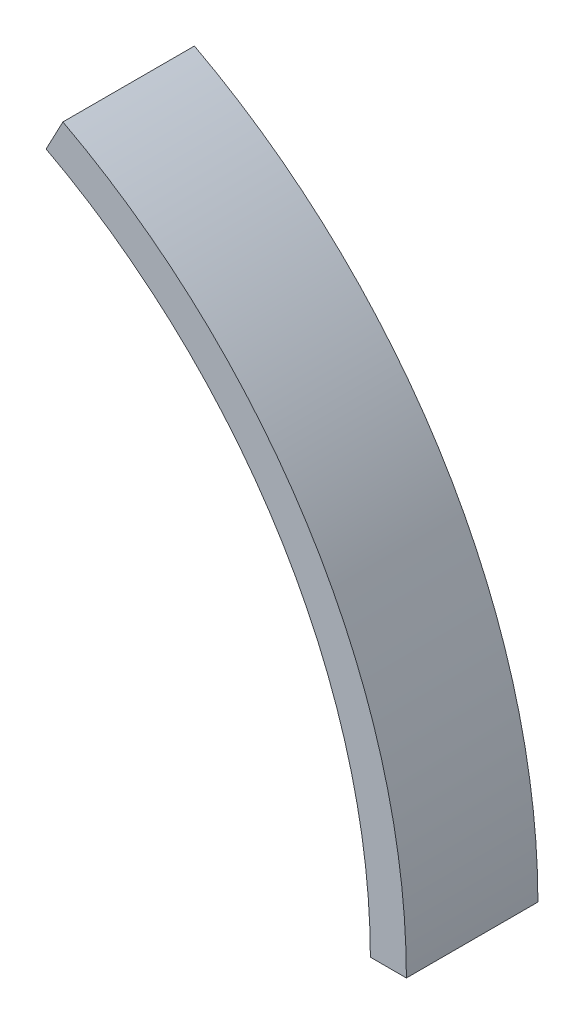
ISO-10303-21;
HEADER;
FILE_DESCRIPTION(('STEP AP214'),'2;1');
FILE_NAME('part.step','',(''),(''),'','','');
FILE_SCHEMA(('AUTOMOTIVE_DESIGN { 1 0 10303 214 1 1 1 1 }'));
ENDSEC;
DATA;
#1=APPLICATION_CONTEXT('core data for automotive mechanical design processes');
#2=APPLICATION_PROTOCOL_DEFINITION('international standard','automotive_design',2000,#1);
#3=PRODUCT_CONTEXT('',#1,'mechanical');
#4=PRODUCT('Part','Part','',(#3));
#5=PRODUCT_RELATED_PRODUCT_CATEGORY('part','',(#4));
#6=PRODUCT_DEFINITION_FORMATION('','',#4);
#7=PRODUCT_DEFINITION_CONTEXT('part definition',#1,'design');
#8=PRODUCT_DEFINITION('design','',#6,#7);
#9=PRODUCT_DEFINITION_SHAPE('','',#8);
#10=(LENGTH_UNIT() NAMED_UNIT(*) SI_UNIT(.MILLI.,.METRE.));
#11=(NAMED_UNIT(*) PLANE_ANGLE_UNIT() SI_UNIT($,.RADIAN.));
#12=(NAMED_UNIT(*) SI_UNIT($,.STERADIAN.) SOLID_ANGLE_UNIT());
#13=UNCERTAINTY_MEASURE_WITH_UNIT(LENGTH_MEASURE(1.E-05),#10,'distance_accuracy_value','');
#14=(GEOMETRIC_REPRESENTATION_CONTEXT(3) GLOBAL_UNCERTAINTY_ASSIGNED_CONTEXT((#13)) GLOBAL_UNIT_ASSIGNED_CONTEXT((#10,
#11,#12)) REPRESENTATION_CONTEXT('',''));
#15=CARTESIAN_POINT('',(0.,0.,0.));
#16=DIRECTION('',(0.,0.,1.));
#17=DIRECTION('',(1.,0.,0.));
#18=AXIS2_PLACEMENT_3D('',#15,#16,#17);
#19=CARTESIAN_POINT('',(0.,0.,4.6355));
#20=DIRECTION('',(0.,0.,-1.));
#21=DIRECTION('',(-1.,0.,0.));
#22=AXIS2_PLACEMENT_3D('',#19,#20,#21);
#23=CYLINDRICAL_SURFACE('',#22,42.8625);
#24=CARTESIAN_POINT('',(0.,0.,-4.6355));
#25=DIRECTION('',(0.,0.,-1.));
#26=DIRECTION('',(1.,0.,0.));
#27=AXIS2_PLACEMENT_3D('',#24,#25,#26);
#28=CIRCLE('',#27,42.8625);
#29=CARTESIAN_POINT('',(20.0025,37.9090213537622,-4.6355));
#30=VERTEX_POINT('',#29);
#31=CARTESIAN_POINT('',(42.8625,0.,-4.6355));
#32=VERTEX_POINT('',#31);
#33=EDGE_CURVE('E111',#30,#32,#28,.T.);
#34=ORIENTED_EDGE('',*,*,#33,.T.);
#35=DIRECTION('',(0.,0.,-1.));
#36=VECTOR('',#35,1.);
#37=CARTESIAN_POINT('',(42.8625,0.,4.6355));
#38=LINE('',#37,#36);
#39=CARTESIAN_POINT('',(42.8625,0.,4.6355));
#40=VERTEX_POINT('',#39);
#41=EDGE_CURVE('E11',#40,#32,#38,.T.);
#42=ORIENTED_EDGE('',*,*,#41,.F.);
#43=CARTESIAN_POINT('',(0.,0.,4.6355));
#44=DIRECTION('',(0.,0.,-1.));
#45=DIRECTION('',(1.,0.,0.));
#46=AXIS2_PLACEMENT_3D('',#43,#44,#45);
#47=CIRCLE('',#46,42.8625);
#48=CARTESIAN_POINT('',(20.0025,37.9090213537622,4.6355));
#49=VERTEX_POINT('',#48);
#50=EDGE_CURVE('E95',#49,#40,#47,.T.);
#51=ORIENTED_EDGE('',*,*,#50,.F.);
#52=DIRECTION('',(0.,0.,-1.));
#53=VECTOR('',#52,1.);
#54=CARTESIAN_POINT('',(20.0025,37.9090213537622,4.6355));
#55=LINE('',#54,#53);
#56=EDGE_CURVE('E107',#49,#30,#55,.T.);
#57=ORIENTED_EDGE('',*,*,#56,.T.);
#58=EDGE_LOOP('',(#34,#42,#51,#57));
#59=FACE_BOUND('',#58,.T.);
#60=ADVANCED_FACE('F43',(#59),#23,.F.);
#61=CARTESIAN_POINT('',(42.8625,0.,4.6355));
#62=DIRECTION('',(0.,1.,0.));
#63=DIRECTION('',(0.,0.,1.));
#64=AXIS2_PLACEMENT_3D('',#61,#62,#63);
#65=PLANE('',#64);
#66=DIRECTION('',(1.,0.,0.));
#67=VECTOR('',#66,1.);
#68=CARTESIAN_POINT('',(42.8625,0.,-4.6355));
#69=LINE('',#68,#67);
#70=CARTESIAN_POINT('',(45.4025,0.,-4.6355));
#71=VERTEX_POINT('',#70);
#72=EDGE_CURVE('E100',#32,#71,#69,.T.);
#73=ORIENTED_EDGE('',*,*,#72,.T.);
#74=DIRECTION('',(0.,0.,-1.));
#75=VECTOR('',#74,1.);
#76=CARTESIAN_POINT('',(45.4025,0.,4.6355));
#77=LINE('',#76,#75);
#78=CARTESIAN_POINT('',(45.4025,0.,4.6355));
#79=VERTEX_POINT('',#78);
#80=EDGE_CURVE('E52',#79,#71,#77,.T.);
#81=ORIENTED_EDGE('',*,*,#80,.F.);
#82=DIRECTION('',(1.,0.,0.));
#83=VECTOR('',#82,1.);
#84=CARTESIAN_POINT('',(42.8625,0.,4.6355));
#85=LINE('',#84,#83);
#86=EDGE_CURVE('E90',#40,#79,#85,.T.);
#87=ORIENTED_EDGE('',*,*,#86,.F.);
#88=ORIENTED_EDGE('',*,*,#41,.T.);
#89=EDGE_LOOP('',(#73,#81,#87,#88));
#90=FACE_BOUND('',#89,.T.);
#91=ADVANCED_FACE('F99',(#90),#65,.F.);
#92=CARTESIAN_POINT('',(0.,0.,4.6355));
#93=DIRECTION('',(0.,0.,-1.));
#94=DIRECTION('',(-1.,0.,0.));
#95=AXIS2_PLACEMENT_3D('',#92,#93,#94);
#96=CYLINDRICAL_SURFACE('',#95,45.4025);
#97=CARTESIAN_POINT('',(0.,0.,-4.6355));
#98=DIRECTION('',(0.,0.,1.));
#99=DIRECTION('',(1.,0.,0.));
#100=AXIS2_PLACEMENT_3D('',#97,#98,#99);
#101=CIRCLE('',#100,45.4025);
#102=CARTESIAN_POINT('',(21.1878333333333,40.1554818784296,-4.6355));
#103=VERTEX_POINT('',#102);
#104=EDGE_CURVE('E77',#71,#103,#101,.T.);
#105=ORIENTED_EDGE('',*,*,#104,.T.);
#106=DIRECTION('',(0.,0.,-1.));
#107=VECTOR('',#106,1.);
#108=CARTESIAN_POINT('',(21.1878333333333,40.1554818784296,4.6355));
#109=LINE('',#108,#107);
#110=CARTESIAN_POINT('',(21.1878333333333,40.1554818784296,4.6355));
#111=VERTEX_POINT('',#110);
#112=EDGE_CURVE('E102',#111,#103,#109,.T.);
#113=ORIENTED_EDGE('',*,*,#112,.F.);
#114=CARTESIAN_POINT('',(0.,0.,4.6355));
#115=DIRECTION('',(0.,0.,1.));
#116=DIRECTION('',(1.,0.,0.));
#117=AXIS2_PLACEMENT_3D('',#114,#115,#116);
#118=CIRCLE('',#117,45.4025);
#119=EDGE_CURVE('E93',#79,#111,#118,.T.);
#120=ORIENTED_EDGE('',*,*,#119,.F.);
#121=ORIENTED_EDGE('',*,*,#80,.T.);
#122=EDGE_LOOP('',(#105,#113,#120,#121));
#123=FACE_BOUND('',#122,.T.);
#124=ADVANCED_FACE('F103',(#123),#96,.T.);
#125=CARTESIAN_POINT('',(20.0025,37.9090213537622,4.6355));
#126=DIRECTION('',(0.884433277428106,-0.466666666666668,0.));
#127=DIRECTION('',(0.466666666666668,0.884433277428106,0.));
#128=AXIS2_PLACEMENT_3D('',#125,#126,#127);
#129=PLANE('',#128);
#130=DIRECTION('',(-0.466666666666668,-0.884433277428106,0.));
#131=VECTOR('',#130,1.);
#132=CARTESIAN_POINT('',(20.0025,37.9090213537622,-4.6355));
#133=LINE('',#132,#131);
#134=EDGE_CURVE('E83',#103,#30,#133,.T.);
#135=ORIENTED_EDGE('',*,*,#134,.T.);
#136=ORIENTED_EDGE('',*,*,#56,.F.);
#137=DIRECTION('',(-0.466666666666668,-0.884433277428106,0.));
#138=VECTOR('',#137,1.);
#139=CARTESIAN_POINT('',(20.0025,37.9090213537622,4.6355));
#140=LINE('',#139,#138);
#141=EDGE_CURVE('E60',#111,#49,#140,.T.);
#142=ORIENTED_EDGE('',*,*,#141,.F.);
#143=ORIENTED_EDGE('',*,*,#112,.T.);
#144=EDGE_LOOP('',(#135,#136,#142,#143));
#145=FACE_BOUND('',#144,.T.);
#146=ADVANCED_FACE('F124',(#145),#129,.F.);
#147=CARTESIAN_POINT('',(0.,0.,4.6355));
#148=DIRECTION('',(0.,0.,1.));
#149=DIRECTION('',(1.,0.,0.));
#150=AXIS2_PLACEMENT_3D('',#147,#148,#149);
#151=PLANE('',#150);
#152=ORIENTED_EDGE('',*,*,#50,.T.);
#153=ORIENTED_EDGE('',*,*,#86,.T.);
#154=ORIENTED_EDGE('',*,*,#119,.T.);
#155=ORIENTED_EDGE('',*,*,#141,.T.);
#156=EDGE_LOOP('',(#152,#153,#154,#155));
#157=FACE_BOUND('',#156,.T.);
#158=ADVANCED_FACE('F91',(#157),#151,.T.);
#159=CARTESIAN_POINT('',(0.,0.,-4.6355));
#160=DIRECTION('',(0.,0.,1.));
#161=DIRECTION('',(1.,0.,0.));
#162=AXIS2_PLACEMENT_3D('',#159,#160,#161);
#163=PLANE('',#162);
#164=ORIENTED_EDGE('',*,*,#33,.F.);
#165=ORIENTED_EDGE('',*,*,#134,.F.);
#166=ORIENTED_EDGE('',*,*,#104,.F.);
#167=ORIENTED_EDGE('',*,*,#72,.F.);
#168=EDGE_LOOP('',(#164,#165,#166,#167));
#169=FACE_BOUND('',#168,.T.);
#170=ADVANCED_FACE('F127',(#169),#163,.F.);
#171=CLOSED_SHELL('',(#60,#91,#124,#146,#158,#170));
#172=MANIFOLD_SOLID_BREP('B2',#171);
#173=ADVANCED_BREP_SHAPE_REPRESENTATION('',(#18,#172),#14);
#174=SHAPE_DEFINITION_REPRESENTATION(#9,#173);
ENDSEC;
END-ISO-10303-21;
